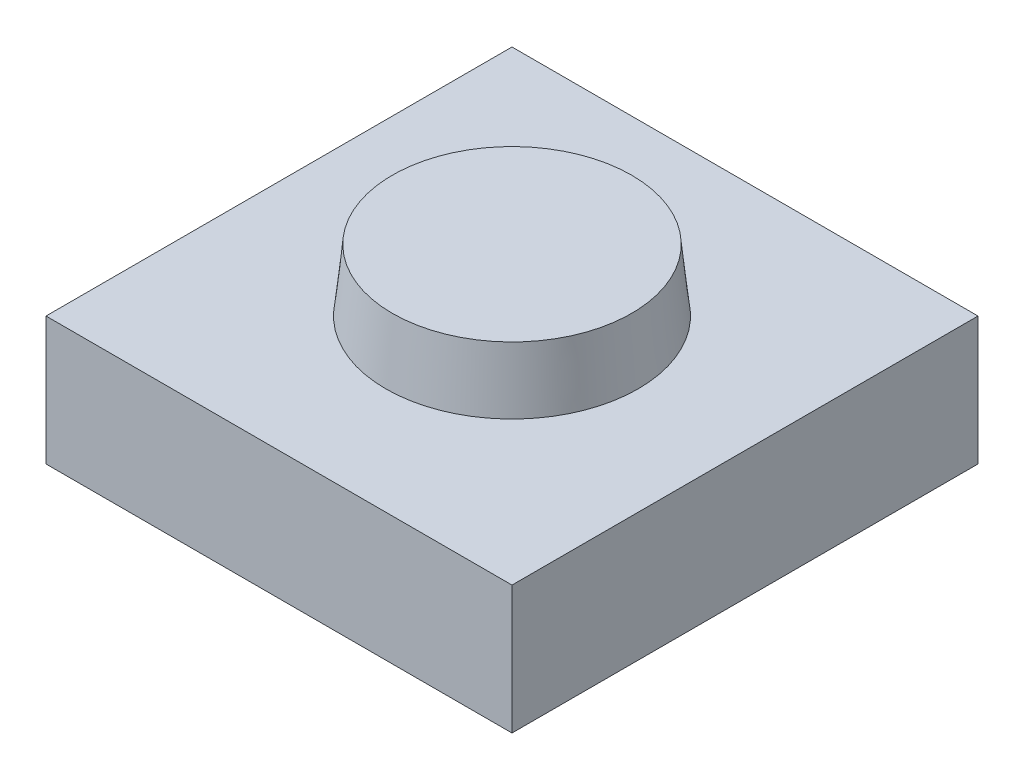
ISO-10303-21;
HEADER;
FILE_DESCRIPTION(('STEP AP214'),'2;1');
FILE_NAME('part.step','',(''),(''),'','','');
FILE_SCHEMA(('AUTOMOTIVE_DESIGN { 1 0 10303 214 1 1 1 1 }'));
ENDSEC;
DATA;
#1=APPLICATION_CONTEXT('core data for automotive mechanical design processes');
#2=APPLICATION_PROTOCOL_DEFINITION('international standard','automotive_design',2000,#1);
#3=PRODUCT_CONTEXT('',#1,'mechanical');
#4=PRODUCT('Part','Part','',(#3));
#5=PRODUCT_RELATED_PRODUCT_CATEGORY('part','',(#4));
#6=PRODUCT_DEFINITION_FORMATION('','',#4);
#7=PRODUCT_DEFINITION_CONTEXT('part definition',#1,'design');
#8=PRODUCT_DEFINITION('design','',#6,#7);
#9=PRODUCT_DEFINITION_SHAPE('','',#8);
#10=(LENGTH_UNIT() NAMED_UNIT(*) SI_UNIT(.MILLI.,.METRE.));
#11=(NAMED_UNIT(*) PLANE_ANGLE_UNIT() SI_UNIT($,.RADIAN.));
#12=(NAMED_UNIT(*) SI_UNIT($,.STERADIAN.) SOLID_ANGLE_UNIT());
#13=UNCERTAINTY_MEASURE_WITH_UNIT(LENGTH_MEASURE(1.E-05),#10,'distance_accuracy_value','');
#14=(GEOMETRIC_REPRESENTATION_CONTEXT(3) GLOBAL_UNCERTAINTY_ASSIGNED_CONTEXT((#13)) GLOBAL_UNIT_ASSIGNED_CONTEXT((#10,
#11,#12)) REPRESENTATION_CONTEXT('',''));
#15=CARTESIAN_POINT('',(0.,0.,0.));
#16=DIRECTION('',(0.,0.,1.));
#17=DIRECTION('',(1.,0.,0.));
#18=AXIS2_PLACEMENT_3D('',#15,#16,#17);
#19=CARTESIAN_POINT('',(-6.,3.3,6.));
#20=DIRECTION('',(1.,0.,0.));
#21=DIRECTION('',(0.,0.,-1.));
#22=AXIS2_PLACEMENT_3D('',#19,#20,#21);
#23=PLANE('',#22);
#24=DIRECTION('',(0.,0.,1.));
#25=VECTOR('',#24,1.);
#26=CARTESIAN_POINT('',(-6.,0.,6.));
#27=LINE('',#26,#25);
#28=CARTESIAN_POINT('',(-6.,0.,-6.));
#29=VERTEX_POINT('',#28);
#30=CARTESIAN_POINT('',(-6.,0.,6.));
#31=VERTEX_POINT('',#30);
#32=EDGE_CURVE('E96',#29,#31,#27,.T.);
#33=ORIENTED_EDGE('',*,*,#32,.T.);
#34=DIRECTION('',(0.,-1.,0.));
#35=VECTOR('',#34,1.);
#36=CARTESIAN_POINT('',(-6.,3.3,6.));
#37=LINE('',#36,#35);
#38=CARTESIAN_POINT('',(-6.,3.3,6.));
#39=VERTEX_POINT('',#38);
#40=EDGE_CURVE('E11',#39,#31,#37,.T.);
#41=ORIENTED_EDGE('',*,*,#40,.F.);
#42=DIRECTION('',(0.,0.,1.));
#43=VECTOR('',#42,1.);
#44=CARTESIAN_POINT('',(-6.,3.3,6.));
#45=LINE('',#44,#43);
#46=CARTESIAN_POINT('',(-6.,3.3,-6.));
#47=VERTEX_POINT('',#46);
#48=EDGE_CURVE('E84',#47,#39,#45,.T.);
#49=ORIENTED_EDGE('',*,*,#48,.F.);
#50=DIRECTION('',(0.,-1.,0.));
#51=VECTOR('',#50,1.);
#52=CARTESIAN_POINT('',(-6.,3.3,-6.));
#53=LINE('',#52,#51);
#54=EDGE_CURVE('E92',#47,#29,#53,.T.);
#55=ORIENTED_EDGE('',*,*,#54,.T.);
#56=EDGE_LOOP('',(#33,#41,#49,#55));
#57=FACE_BOUND('',#56,.T.);
#58=ADVANCED_FACE('F33',(#57),#23,.F.);
#59=CARTESIAN_POINT('',(6.,3.3,6.));
#60=DIRECTION('',(0.,0.,-1.));
#61=DIRECTION('',(-1.,0.,0.));
#62=AXIS2_PLACEMENT_3D('',#59,#60,#61);
#63=PLANE('',#62);
#64=DIRECTION('',(1.,0.,0.));
#65=VECTOR('',#64,1.);
#66=CARTESIAN_POINT('',(6.,0.,6.));
#67=LINE('',#66,#65);
#68=CARTESIAN_POINT('',(6.,0.,6.));
#69=VERTEX_POINT('',#68);
#70=EDGE_CURVE('E88',#31,#69,#67,.T.);
#71=ORIENTED_EDGE('',*,*,#70,.T.);
#72=DIRECTION('',(0.,-1.,0.));
#73=VECTOR('',#72,1.);
#74=CARTESIAN_POINT('',(6.,3.3,6.));
#75=LINE('',#74,#73);
#76=CARTESIAN_POINT('',(6.,3.3,6.));
#77=VERTEX_POINT('',#76);
#78=EDGE_CURVE('E41',#77,#69,#75,.T.);
#79=ORIENTED_EDGE('',*,*,#78,.F.);
#80=DIRECTION('',(1.,0.,0.));
#81=VECTOR('',#80,1.);
#82=CARTESIAN_POINT('',(6.,3.3,6.));
#83=LINE('',#82,#81);
#84=EDGE_CURVE('E79',#39,#77,#83,.T.);
#85=ORIENTED_EDGE('',*,*,#84,.F.);
#86=ORIENTED_EDGE('',*,*,#40,.T.);
#87=EDGE_LOOP('',(#71,#79,#85,#86));
#88=FACE_BOUND('',#87,.T.);
#89=ADVANCED_FACE('F87',(#88),#63,.F.);
#90=CARTESIAN_POINT('',(6.,3.3,6.));
#91=DIRECTION('',(-1.,0.,0.));
#92=DIRECTION('',(0.,0.,1.));
#93=AXIS2_PLACEMENT_3D('',#90,#91,#92);
#94=PLANE('',#93);
#95=DIRECTION('',(0.,0.,-1.));
#96=VECTOR('',#95,1.);
#97=CARTESIAN_POINT('',(6.,0.,6.));
#98=LINE('',#97,#96);
#99=CARTESIAN_POINT('',(6.,0.,-6.));
#100=VERTEX_POINT('',#99);
#101=EDGE_CURVE('E66',#69,#100,#98,.T.);
#102=ORIENTED_EDGE('',*,*,#101,.T.);
#103=DIRECTION('',(0.,-1.,0.));
#104=VECTOR('',#103,1.);
#105=CARTESIAN_POINT('',(6.,3.3,-6.));
#106=LINE('',#105,#104);
#107=CARTESIAN_POINT('',(6.,3.3,-6.));
#108=VERTEX_POINT('',#107);
#109=EDGE_CURVE('E89',#108,#100,#106,.T.);
#110=ORIENTED_EDGE('',*,*,#109,.F.);
#111=DIRECTION('',(0.,0.,-1.));
#112=VECTOR('',#111,1.);
#113=CARTESIAN_POINT('',(6.,3.3,6.));
#114=LINE('',#113,#112);
#115=EDGE_CURVE('E82',#77,#108,#114,.T.);
#116=ORIENTED_EDGE('',*,*,#115,.F.);
#117=ORIENTED_EDGE('',*,*,#78,.T.);
#118=EDGE_LOOP('',(#102,#110,#116,#117));
#119=FACE_BOUND('',#118,.T.);
#120=ADVANCED_FACE('F90',(#119),#94,.F.);
#121=CARTESIAN_POINT('',(6.,3.3,-6.));
#122=DIRECTION('',(0.,0.,1.));
#123=DIRECTION('',(1.,0.,0.));
#124=AXIS2_PLACEMENT_3D('',#121,#122,#123);
#125=PLANE('',#124);
#126=DIRECTION('',(-1.,0.,0.));
#127=VECTOR('',#126,1.);
#128=CARTESIAN_POINT('',(6.,0.,-6.));
#129=LINE('',#128,#127);
#130=EDGE_CURVE('E72',#100,#29,#129,.T.);
#131=ORIENTED_EDGE('',*,*,#130,.T.);
#132=ORIENTED_EDGE('',*,*,#54,.F.);
#133=DIRECTION('',(-1.,0.,0.));
#134=VECTOR('',#133,1.);
#135=CARTESIAN_POINT('',(6.,3.3,-6.));
#136=LINE('',#135,#134);
#137=EDGE_CURVE('E49',#108,#47,#136,.T.);
#138=ORIENTED_EDGE('',*,*,#137,.F.);
#139=ORIENTED_EDGE('',*,*,#109,.T.);
#140=EDGE_LOOP('',(#131,#132,#138,#139));
#141=FACE_BOUND('',#140,.T.);
#142=ADVANCED_FACE('F104',(#141),#125,.F.);
#143=CARTESIAN_POINT('',(0.,3.3,0.));
#144=DIRECTION('',(0.,1.,0.));
#145=DIRECTION('',(0.,0.,1.));
#146=AXIS2_PLACEMENT_3D('',#143,#144,#145);
#147=PLANE('',#146);
#148=CARTESIAN_POINT('',(0.,3.3,0.));
#149=DIRECTION('',(0.,1.,0.));
#150=DIRECTION('',(0.,0.,1.));
#151=AXIS2_PLACEMENT_3D('',#148,#149,#150);
#152=CIRCLE('',#151,3.25);
#153=CARTESIAN_POINT('',(0.,3.3,3.25));
#154=VERTEX_POINT('',#153);
#155=EDGE_CURVE('E112',#154,#154,#152,.T.);
#156=ORIENTED_EDGE('',*,*,#155,.F.);
#157=EDGE_LOOP('',(#156));
#158=FACE_BOUND('',#157,.T.);
#159=ORIENTED_EDGE('',*,*,#48,.T.);
#160=ORIENTED_EDGE('',*,*,#84,.T.);
#161=ORIENTED_EDGE('',*,*,#115,.T.);
#162=ORIENTED_EDGE('',*,*,#137,.T.);
#163=EDGE_LOOP('',(#159,#160,#161,#162));
#164=FACE_BOUND('',#163,.T.);
#165=ADVANCED_FACE('F80',(#158,#164),#147,.T.);
#166=CARTESIAN_POINT('',(0.,0.,0.));
#167=DIRECTION('',(0.,1.,0.));
#168=DIRECTION('',(0.,0.,1.));
#169=AXIS2_PLACEMENT_3D('',#166,#167,#168);
#170=PLANE('',#169);
#171=ORIENTED_EDGE('',*,*,#32,.F.);
#172=ORIENTED_EDGE('',*,*,#130,.F.);
#173=ORIENTED_EDGE('',*,*,#101,.F.);
#174=ORIENTED_EDGE('',*,*,#70,.F.);
#175=EDGE_LOOP('',(#171,#172,#173,#174));
#176=FACE_BOUND('',#175,.T.);
#177=ADVANCED_FACE('F107',(#176),#170,.F.);
#178=CARTESIAN_POINT('',(0.,3.3,0.));
#179=DIRECTION('',(0.,-1.,0.));
#180=DIRECTION('',(0.,0.,1.));
#181=AXIS2_PLACEMENT_3D('',#178,#179,#180);
#182=CONICAL_SURFACE('',#181,3.25,0.10471975511966);
#183=CARTESIAN_POINT('',(0.,4.9,0.));
#184=DIRECTION('',(0.,1.,0.));
#185=DIRECTION('',(0.,0.,1.));
#186=AXIS2_PLACEMENT_3D('',#183,#184,#185);
#187=CIRCLE('',#186,3.08183322357492);
#188=CARTESIAN_POINT('',(0.,4.9,3.08183322357492));
#189=VERTEX_POINT('',#188);
#190=EDGE_CURVE('E99',#189,#189,#187,.T.);
#191=ORIENTED_EDGE('',*,*,#190,.F.);
#192=EDGE_LOOP('',(#191));
#193=FACE_BOUND('',#192,.T.);
#194=ORIENTED_EDGE('',*,*,#155,.T.);
#195=EDGE_LOOP('',(#194));
#196=FACE_BOUND('',#195,.T.);
#197=ADVANCED_FACE('F116',(#193,#196),#182,.T.);
#198=CARTESIAN_POINT('',(0.,4.9,0.));
#199=DIRECTION('',(0.,1.,0.));
#200=DIRECTION('',(0.,0.,1.));
#201=AXIS2_PLACEMENT_3D('',#198,#199,#200);
#202=PLANE('',#201);
#203=ORIENTED_EDGE('',*,*,#190,.T.);
#204=EDGE_LOOP('',(#203));
#205=FACE_BOUND('',#204,.T.);
#206=ADVANCED_FACE('F160',(#205),#202,.T.);
#207=CLOSED_SHELL('',(#58,#89,#120,#142,#165,#177,#197,#206));
#208=MANIFOLD_SOLID_BREP('B2',#207);
#209=ADVANCED_BREP_SHAPE_REPRESENTATION('',(#18,#208),#14);
#210=SHAPE_DEFINITION_REPRESENTATION(#9,#209);
ENDSEC;
END-ISO-10303-21;
